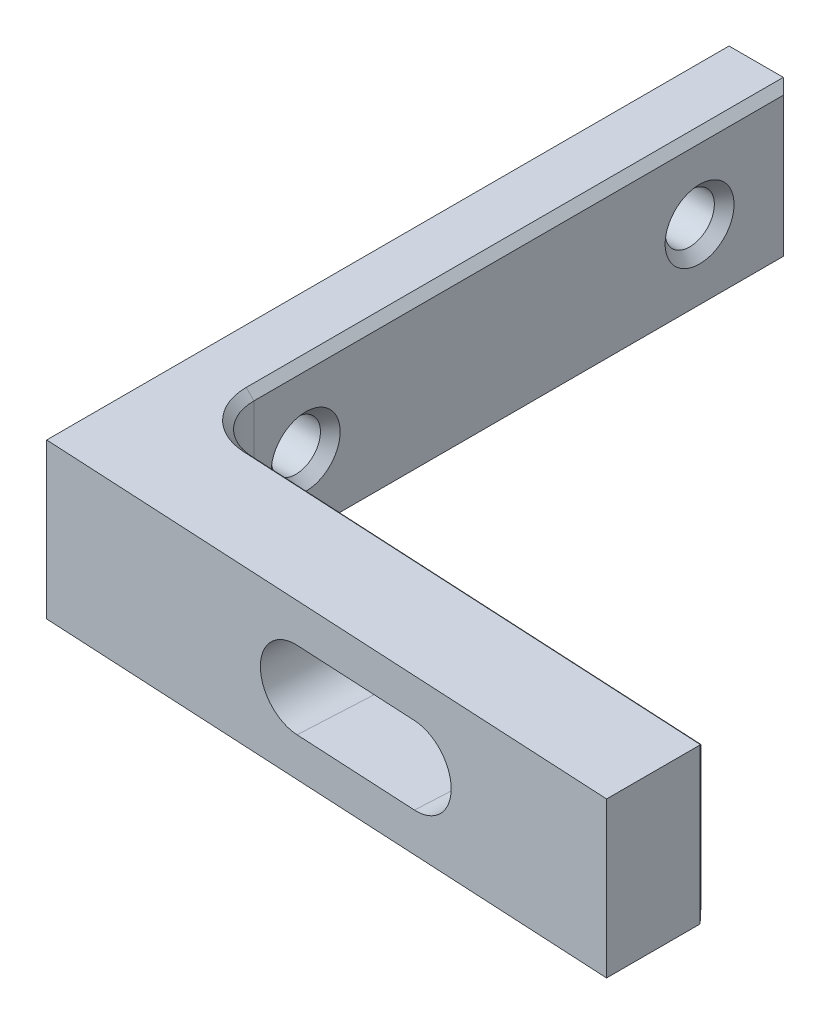
ISO-10303-21;
HEADER;
FILE_DESCRIPTION(('STEP AP214'),'2;1');
FILE_NAME('part.step','',(''),(''),'','','');
FILE_SCHEMA(('AUTOMOTIVE_DESIGN { 1 0 10303 214 1 1 1 1 }'));
ENDSEC;
DATA;
#1=APPLICATION_CONTEXT('core data for automotive mechanical design processes');
#2=APPLICATION_PROTOCOL_DEFINITION('international standard','automotive_design',2000,#1);
#3=PRODUCT_CONTEXT('',#1,'mechanical');
#4=PRODUCT('Part','Part','',(#3));
#5=PRODUCT_RELATED_PRODUCT_CATEGORY('part','',(#4));
#6=PRODUCT_DEFINITION_FORMATION('','',#4);
#7=PRODUCT_DEFINITION_CONTEXT('part definition',#1,'design');
#8=PRODUCT_DEFINITION('design','',#6,#7);
#9=PRODUCT_DEFINITION_SHAPE('','',#8);
#10=(LENGTH_UNIT() NAMED_UNIT(*) SI_UNIT(.MILLI.,.METRE.));
#11=(NAMED_UNIT(*) PLANE_ANGLE_UNIT() SI_UNIT($,.RADIAN.));
#12=(NAMED_UNIT(*) SI_UNIT($,.STERADIAN.) SOLID_ANGLE_UNIT());
#13=UNCERTAINTY_MEASURE_WITH_UNIT(LENGTH_MEASURE(1.E-05),#10,'distance_accuracy_value','');
#14=(GEOMETRIC_REPRESENTATION_CONTEXT(3) GLOBAL_UNCERTAINTY_ASSIGNED_CONTEXT((#13)) GLOBAL_UNIT_ASSIGNED_CONTEXT((#10,
#11,#12)) REPRESENTATION_CONTEXT('',''));
#15=CARTESIAN_POINT('',(0.,0.,0.));
#16=DIRECTION('',(0.,0.,1.));
#17=DIRECTION('',(1.,0.,0.));
#18=AXIS2_PLACEMENT_3D('',#15,#16,#17);
#19=CARTESIAN_POINT('',(19.05,10.,22.));
#20=DIRECTION('',(-1.,0.,0.));
#21=DIRECTION('',(0.,0.,1.));
#22=AXIS2_PLACEMENT_3D('',#19,#20,#21);
#23=PLANE('',#22);
#24=DIRECTION('',(0.,0.,-1.));
#25=VECTOR('',#24,1.);
#26=CARTESIAN_POINT('',(19.05,0.,22.));
#27=LINE('',#26,#25);
#28=CARTESIAN_POINT('',(19.05,0.,23.9967363906839));
#29=VERTEX_POINT('',#28);
#30=CARTESIAN_POINT('',(19.05,0.,17.9654825249185));
#31=VERTEX_POINT('',#30);
#32=EDGE_CURVE('E211',#29,#31,#27,.T.);
#33=ORIENTED_EDGE('',*,*,#32,.T.);
#34=DIRECTION('',(0.,1.,0.));
#35=VECTOR('',#34,1.);
#36=CARTESIAN_POINT('',(19.05,10.,17.9654825249185));
#37=LINE('',#36,#35);
#38=CARTESIAN_POINT('',(19.05,10.,17.9654825249185));
#39=VERTEX_POINT('',#38);
#40=EDGE_CURVE('E260',#31,#39,#37,.T.);
#41=ORIENTED_EDGE('',*,*,#40,.T.);
#42=DIRECTION('',(0.,0.,-1.));
#43=VECTOR('',#42,1.);
#44=CARTESIAN_POINT('',(19.05,10.,22.));
#45=LINE('',#44,#43);
#46=CARTESIAN_POINT('',(19.05,10.,23.9967363906839));
#47=VERTEX_POINT('',#46);
#48=EDGE_CURVE('E212',#47,#39,#45,.T.);
#49=ORIENTED_EDGE('',*,*,#48,.F.);
#50=DIRECTION('',(0.,1.,0.));
#51=VECTOR('',#50,1.);
#52=CARTESIAN_POINT('',(19.05,10.,23.9967363906839));
#53=LINE('',#52,#51);
#54=EDGE_CURVE('E231',#47,#29,#53,.F.);
#55=ORIENTED_EDGE('',*,*,#54,.T.);
#56=EDGE_LOOP('',(#33,#41,#49,#55));
#57=FACE_BOUND('',#56,.T.);
#58=ADVANCED_FACE('F31',(#57),#23,.F.);
#59=CARTESIAN_POINT('',(-19.05,10.,-22.));
#60=DIRECTION('',(0.,0.,1.));
#61=DIRECTION('',(1.,0.,0.));
#62=AXIS2_PLACEMENT_3D('',#59,#60,#61);
#63=PLANE('',#62);
#64=DIRECTION('',(-1.,0.,0.));
#65=VECTOR('',#64,1.);
#66=CARTESIAN_POINT('',(-19.05,10.,-22.));
#67=LINE('',#66,#65);
#68=CARTESIAN_POINT('',(-15.55,10.,-22.));
#69=VERTEX_POINT('',#68);
#70=CARTESIAN_POINT('',(-19.05,10.,-22.));
#71=VERTEX_POINT('',#70);
#72=EDGE_CURVE('E215',#69,#71,#67,.T.);
#73=ORIENTED_EDGE('',*,*,#72,.F.);
#74=DIRECTION('',(0.,-1.,0.));
#75=VECTOR('',#74,1.);
#76=CARTESIAN_POINT('',(-15.55,10.,-22.));
#77=LINE('',#76,#75);
#78=CARTESIAN_POINT('',(-15.55,0.,-22.));
#79=VERTEX_POINT('',#78);
#80=EDGE_CURVE('E11',#69,#79,#77,.T.);
#81=ORIENTED_EDGE('',*,*,#80,.T.);
#82=DIRECTION('',(-1.,0.,0.));
#83=VECTOR('',#82,1.);
#84=CARTESIAN_POINT('',(-19.05,0.,-22.));
#85=LINE('',#84,#83);
#86=CARTESIAN_POINT('',(-19.05,0.,-22.));
#87=VERTEX_POINT('',#86);
#88=EDGE_CURVE('E223',#79,#87,#85,.T.);
#89=ORIENTED_EDGE('',*,*,#88,.T.);
#90=DIRECTION('',(0.,-1.,0.));
#91=VECTOR('',#90,1.);
#92=CARTESIAN_POINT('',(-19.05,10.,-22.));
#93=LINE('',#92,#91);
#94=EDGE_CURVE('E230',#71,#87,#93,.T.);
#95=ORIENTED_EDGE('',*,*,#94,.F.);
#96=EDGE_LOOP('',(#73,#81,#89,#95));
#97=FACE_BOUND('',#96,.T.);
#98=ADVANCED_FACE('F359',(#97),#63,.F.);
#99=CARTESIAN_POINT('',(-19.05,10.,22.));
#100=DIRECTION('',(1.,0.,0.));
#101=DIRECTION('',(0.,0.,-1.));
#102=AXIS2_PLACEMENT_3D('',#99,#100,#101);
#103=PLANE('',#102);
#104=CARTESIAN_POINT('',(-19.05,5.,-16.1));
#105=DIRECTION('',(-1.,0.,0.));
#106=DIRECTION('',(0.,0.,1.));
#107=AXIS2_PLACEMENT_3D('',#104,#105,#106);
#108=CIRCLE('',#107,2.2225);
#109=CARTESIAN_POINT('',(-19.05,5.,-13.8775));
#110=VERTEX_POINT('',#109);
#111=EDGE_CURVE('E186',#110,#110,#108,.T.);
#112=ORIENTED_EDGE('',*,*,#111,.F.);
#113=EDGE_LOOP('',(#112));
#114=FACE_BOUND('',#113,.T.);
#115=CARTESIAN_POINT('',(-19.05,5.,9.3));
#116=DIRECTION('',(-1.,0.,0.));
#117=DIRECTION('',(0.,0.,1.));
#118=AXIS2_PLACEMENT_3D('',#115,#116,#117);
#119=CIRCLE('',#118,2.2225);
#120=CARTESIAN_POINT('',(-19.05,5.,11.5225));
#121=VERTEX_POINT('',#120);
#122=EDGE_CURVE('E202',#121,#121,#119,.T.);
#123=ORIENTED_EDGE('',*,*,#122,.F.);
#124=EDGE_LOOP('',(#123));
#125=FACE_BOUND('',#124,.T.);
#126=DIRECTION('',(0.,0.,1.));
#127=VECTOR('',#126,1.);
#128=CARTESIAN_POINT('',(-19.05,0.,22.));
#129=LINE('',#128,#127);
#130=CARTESIAN_POINT('',(-19.05,0.,22.));
#131=VERTEX_POINT('',#130);
#132=EDGE_CURVE('E225',#87,#131,#129,.T.);
#133=ORIENTED_EDGE('',*,*,#132,.T.);
#134=DIRECTION('',(0.,-1.,0.));
#135=VECTOR('',#134,1.);
#136=CARTESIAN_POINT('',(-19.05,10.,22.));
#137=LINE('',#136,#135);
#138=CARTESIAN_POINT('',(-19.05,10.,22.));
#139=VERTEX_POINT('',#138);
#140=EDGE_CURVE('E227',#139,#131,#137,.T.);
#141=ORIENTED_EDGE('',*,*,#140,.F.);
#142=DIRECTION('',(0.,0.,1.));
#143=VECTOR('',#142,1.);
#144=CARTESIAN_POINT('',(-19.05,10.,22.));
#145=LINE('',#144,#143);
#146=EDGE_CURVE('E218',#71,#139,#145,.T.);
#147=ORIENTED_EDGE('',*,*,#146,.F.);
#148=ORIENTED_EDGE('',*,*,#94,.T.);
#149=EDGE_LOOP('',(#133,#141,#147,#148));
#150=FACE_BOUND('',#149,.T.);
#151=ADVANCED_FACE('F362',(#114,#125,#150),#103,.F.);
#152=CARTESIAN_POINT('',(-19.05,10.,22.));
#153=DIRECTION('',(-0.0523359562429439,0.,0.998629534754574));
#154=DIRECTION('',(0.998629534754574,0.,0.052335956242944));
#155=AXIS2_PLACEMENT_3D('',#152,#153,#154);
#156=PLANE('',#155);
#157=DIRECTION('',(-0.998629534754574,0.,-0.052335956242944));
#158=VECTOR('',#157,1.);
#159=CARTESIAN_POINT('',(-19.05,7.5,22.));
#160=LINE('',#159,#158);
#161=CARTESIAN_POINT('',(-2.01119831442696,7.5,22.892965757985));
#162=VERTEX_POINT('',#161);
#163=CARTESIAN_POINT('',(5.97783796360964,7.5,23.3116534079286));
#164=VERTEX_POINT('',#163);
#165=EDGE_CURVE('E182',#162,#164,#160,.F.);
#166=ORIENTED_EDGE('',*,*,#165,.T.);
#167=CARTESIAN_POINT('',(5.97783796360963,5.,23.3116534079286));
#168=DIRECTION('',(-0.0523359562429439,0.,0.998629534754574));
#169=DIRECTION('',(0.998629534754574,0.,0.052335956242944));
#170=AXIS2_PLACEMENT_3D('',#167,#168,#169);
#171=CIRCLE('',#170,2.5);
#172=CARTESIAN_POINT('',(5.97783796360964,2.5,23.3116534079286));
#173=VERTEX_POINT('',#172);
#174=EDGE_CURVE('E173',#164,#173,#171,.F.);
#175=ORIENTED_EDGE('',*,*,#174,.T.);
#176=DIRECTION('',(0.998629534754574,0.,0.052335956242944));
#177=VECTOR('',#176,1.);
#178=CARTESIAN_POINT('',(-19.05,2.5,22.));
#179=LINE('',#178,#177);
#180=CARTESIAN_POINT('',(-2.01119831442696,2.5,22.892965757985));
#181=VERTEX_POINT('',#180);
#182=EDGE_CURVE('E156',#173,#181,#179,.F.);
#183=ORIENTED_EDGE('',*,*,#182,.T.);
#184=CARTESIAN_POINT('',(-2.01119831442696,5.,22.892965757985));
#185=DIRECTION('',(-0.0523359562429439,0.,0.998629534754574));
#186=DIRECTION('',(0.998629534754574,0.,0.052335956242944));
#187=AXIS2_PLACEMENT_3D('',#184,#185,#186);
#188=CIRCLE('',#187,2.5);
#189=EDGE_CURVE('E167',#181,#162,#188,.F.);
#190=ORIENTED_EDGE('',*,*,#189,.T.);
#191=EDGE_LOOP('',(#166,#175,#183,#190));
#192=FACE_BOUND('',#191,.T.);
#193=DIRECTION('',(-0.998629534754574,0.,-0.052335956242944));
#194=VECTOR('',#193,1.);
#195=CARTESIAN_POINT('',(16.6460159148772,0.,23.8707489233508));
#196=LINE('',#195,#194);
#197=EDGE_CURVE('E216',#131,#29,#196,.F.);
#198=ORIENTED_EDGE('',*,*,#197,.T.);
#199=ORIENTED_EDGE('',*,*,#54,.F.);
#200=DIRECTION('',(-0.998629534754574,0.,-0.052335956242944));
#201=VECTOR('',#200,1.);
#202=CARTESIAN_POINT('',(16.6460159148772,10.,23.8707489233508));
#203=LINE('',#202,#201);
#204=EDGE_CURVE('E220',#139,#47,#203,.F.);
#205=ORIENTED_EDGE('',*,*,#204,.F.);
#206=ORIENTED_EDGE('',*,*,#140,.T.);
#207=EDGE_LOOP('',(#198,#199,#205,#206));
#208=FACE_BOUND('',#207,.T.);
#209=ADVANCED_FACE('F180',(#192,#208),#156,.T.);
#210=CARTESIAN_POINT('',(19.05,10.,-22.));
#211=DIRECTION('',(0.,-1.,0.));
#212=DIRECTION('',(0.,0.,-1.));
#213=AXIS2_PLACEMENT_3D('',#210,#211,#212);
#214=PLANE('',#213);
#215=ORIENTED_EDGE('',*,*,#48,.T.);
#216=DIRECTION('',(0.669130606358856,0.,0.743144825477396));
#217=VECTOR('',#216,1.);
#218=CARTESIAN_POINT('',(19.05,10.,17.9654825249185));
#219=LINE('',#218,#217);
#220=CARTESIAN_POINT('',(19.0238320218786,10.,17.936420040929));
#221=VERTEX_POINT('',#220);
#222=EDGE_CURVE('E278',#39,#221,#219,.F.);
#223=ORIENTED_EDGE('',*,*,#222,.T.);
#224=DIRECTION('',(-0.998629534754574,0.,-0.052335956242944));
#225=VECTOR('',#224,1.);
#226=CARTESIAN_POINT('',(16.962682016894,10.,17.8283997463985));
#227=LINE('',#226,#225);
#228=CARTESIAN_POINT('',(-12.0673346391928,10.,16.3070010409033));
#229=VERTEX_POINT('',#228);
#230=EDGE_CURVE('E276',#221,#229,#227,.T.);
#231=ORIENTED_EDGE('',*,*,#230,.T.);
#232=CARTESIAN_POINT('',(-11.875,10.,12.6370375006803));
#233=DIRECTION('',(0.,-1.,0.));
#234=DIRECTION('',(0.,0.,-1.));
#235=AXIS2_PLACEMENT_3D('',#232,#233,#234);
#236=CIRCLE('',#235,3.675);
#237=CARTESIAN_POINT('',(-15.55,10.,12.6370375006803));
#238=VERTEX_POINT('',#237);
#239=EDGE_CURVE('E274',#229,#238,#236,.T.);
#240=ORIENTED_EDGE('',*,*,#239,.T.);
#241=DIRECTION('',(0.,0.,-1.));
#242=VECTOR('',#241,1.);
#243=CARTESIAN_POINT('',(-15.55,10.,-22.));
#244=LINE('',#243,#242);
#245=EDGE_CURVE('E272',#238,#69,#244,.T.);
#246=ORIENTED_EDGE('',*,*,#245,.T.);
#247=ORIENTED_EDGE('',*,*,#72,.T.);
#248=ORIENTED_EDGE('',*,*,#146,.T.);
#249=ORIENTED_EDGE('',*,*,#204,.T.);
#250=EDGE_LOOP('',(#215,#223,#231,#240,#246,#247,#248,#249));
#251=FACE_BOUND('',#250,.T.);
#252=ADVANCED_FACE('F366',(#251),#214,.F.);
#253=CARTESIAN_POINT('',(19.05,0.,-22.));
#254=DIRECTION('',(0.,-1.,0.));
#255=DIRECTION('',(0.,0.,-1.));
#256=AXIS2_PLACEMENT_3D('',#253,#254,#255);
#257=PLANE('',#256);
#258=DIRECTION('',(0.998629534754574,0.,0.052335956242944));
#259=VECTOR('',#258,1.);
#260=CARTESIAN_POINT('',(19.0238320218785,0.,17.936420040929));
#261=LINE('',#260,#259);
#262=CARTESIAN_POINT('',(-12.0673346391928,0.,16.3070010409033));
#263=VERTEX_POINT('',#262);
#264=CARTESIAN_POINT('',(19.0238320218786,0.,17.936420040929));
#265=VERTEX_POINT('',#264);
#266=EDGE_CURVE('E291',#263,#265,#261,.T.);
#267=ORIENTED_EDGE('',*,*,#266,.T.);
#268=DIRECTION('',(-0.669130606358856,0.,-0.743144825477396));
#269=VECTOR('',#268,1.);
#270=CARTESIAN_POINT('',(-0.823273714994747,0.,-4.10602397358089));
#271=LINE('',#270,#269);
#272=EDGE_CURVE('E293',#265,#31,#271,.F.);
#273=ORIENTED_EDGE('',*,*,#272,.T.);
#274=ORIENTED_EDGE('',*,*,#32,.F.);
#275=ORIENTED_EDGE('',*,*,#197,.F.);
#276=ORIENTED_EDGE('',*,*,#132,.F.);
#277=ORIENTED_EDGE('',*,*,#88,.F.);
#278=DIRECTION('',(0.,0.,1.));
#279=VECTOR('',#278,1.);
#280=CARTESIAN_POINT('',(-15.55,0.,12.6370375006803));
#281=LINE('',#280,#279);
#282=CARTESIAN_POINT('',(-15.55,0.,12.6370375006803));
#283=VERTEX_POINT('',#282);
#284=EDGE_CURVE('E287',#79,#283,#281,.T.);
#285=ORIENTED_EDGE('',*,*,#284,.T.);
#286=CARTESIAN_POINT('',(-11.875,0.,12.6370375006803));
#287=DIRECTION('',(0.,-1.,0.));
#288=DIRECTION('',(0.,0.,-1.));
#289=AXIS2_PLACEMENT_3D('',#286,#287,#288);
#290=CIRCLE('',#289,3.675);
#291=EDGE_CURVE('E289',#283,#263,#290,.F.);
#292=ORIENTED_EDGE('',*,*,#291,.T.);
#293=EDGE_LOOP('',(#267,#273,#274,#275,#276,#277,#285,#292));
#294=FACE_BOUND('',#293,.T.);
#295=ADVANCED_FACE('F351',(#294),#257,.T.);
#296=CARTESIAN_POINT('',(-15.05,-0.000999999999999265,-22.));
#297=DIRECTION('',(-1.,0.,0.));
#298=DIRECTION('',(0.,0.,1.));
#299=AXIS2_PLACEMENT_3D('',#296,#297,#298);
#300=PLANE('',#299);
#301=CARTESIAN_POINT('',(-15.05,5.,-16.1));
#302=DIRECTION('',(-1.,0.,0.));
#303=DIRECTION('',(0.,0.,1.));
#304=AXIS2_PLACEMENT_3D('',#301,#302,#303);
#305=CIRCLE('',#304,2.2225);
#306=CARTESIAN_POINT('',(-15.05,5.,-13.8775));
#307=VERTEX_POINT('',#306);
#308=EDGE_CURVE('E183',#307,#307,#305,.T.);
#309=ORIENTED_EDGE('',*,*,#308,.T.);
#310=EDGE_LOOP('',(#309));
#311=FACE_BOUND('',#310,.T.);
#312=CARTESIAN_POINT('',(-15.05,5.,9.3));
#313=DIRECTION('',(-1.,0.,0.));
#314=DIRECTION('',(0.,0.,1.));
#315=AXIS2_PLACEMENT_3D('',#312,#313,#314);
#316=CIRCLE('',#315,2.2225);
#317=CARTESIAN_POINT('',(-15.05,5.,11.5225));
#318=VERTEX_POINT('',#317);
#319=EDGE_CURVE('E199',#318,#318,#316,.T.);
#320=ORIENTED_EDGE('',*,*,#319,.T.);
#321=EDGE_LOOP('',(#320));
#322=FACE_BOUND('',#321,.T.);
#323=DIRECTION('',(0.,1.,0.));
#324=VECTOR('',#323,1.);
#325=CARTESIAN_POINT('',(-15.05,-0.000999999999999265,-21.5));
#326=LINE('',#325,#324);
#327=CARTESIAN_POINT('',(-15.05,0.5,-21.5));
#328=VERTEX_POINT('',#327);
#329=CARTESIAN_POINT('',(-15.05,9.5,-21.5));
#330=VERTEX_POINT('',#329);
#331=EDGE_CURVE('E48',#328,#330,#326,.T.);
#332=ORIENTED_EDGE('',*,*,#331,.T.);
#333=DIRECTION('',(0.,0.,1.));
#334=VECTOR('',#333,1.);
#335=CARTESIAN_POINT('',(-15.05,9.5,-22.));
#336=LINE('',#335,#334);
#337=CARTESIAN_POINT('',(-15.05,9.5,12.6370375006803));
#338=VERTEX_POINT('',#337);
#339=EDGE_CURVE('E40',#330,#338,#336,.T.);
#340=ORIENTED_EDGE('',*,*,#339,.T.);
#341=DIRECTION('',(0.,1.,0.));
#342=VECTOR('',#341,1.);
#343=CARTESIAN_POINT('',(-15.05,0.,12.6370375006803));
#344=LINE('',#343,#342);
#345=CARTESIAN_POINT('',(-15.05,0.5,12.6370375006803));
#346=VERTEX_POINT('',#345);
#347=EDGE_CURVE('E241',#338,#346,#344,.F.);
#348=ORIENTED_EDGE('',*,*,#347,.T.);
#349=DIRECTION('',(0.,0.,-1.));
#350=VECTOR('',#349,1.);
#351=CARTESIAN_POINT('',(-15.05,0.5,-22.));
#352=LINE('',#351,#350);
#353=EDGE_CURVE('E53',#346,#328,#352,.T.);
#354=ORIENTED_EDGE('',*,*,#353,.T.);
#355=EDGE_LOOP('',(#332,#340,#348,#354));
#356=FACE_BOUND('',#355,.T.);
#357=ADVANCED_FACE('F335',(#311,#322,#356),#300,.F.);
#358=CARTESIAN_POINT('',(-15.685,5.,9.3));
#359=DIRECTION('',(1.,0.,0.));
#360=DIRECTION('',(0.,0.,-1.));
#361=AXIS2_PLACEMENT_3D('',#358,#359,#360);
#362=CONICAL_SURFACE('',#361,1.5875,0.785398163397448);
#363=ORIENTED_EDGE('',*,*,#319,.F.);
#364=EDGE_LOOP('',(#363));
#365=FACE_BOUND('',#364,.T.);
#366=CARTESIAN_POINT('',(-15.685,5.,9.3));
#367=DIRECTION('',(-1.,0.,0.));
#368=DIRECTION('',(0.,0.,1.));
#369=AXIS2_PLACEMENT_3D('',#366,#367,#368);
#370=CIRCLE('',#369,1.5875);
#371=CARTESIAN_POINT('',(-15.685,5.,10.8875));
#372=VERTEX_POINT('',#371);
#373=EDGE_CURVE('E208',#372,#372,#370,.T.);
#374=ORIENTED_EDGE('',*,*,#373,.T.);
#375=EDGE_LOOP('',(#374));
#376=FACE_BOUND('',#375,.T.);
#377=ADVANCED_FACE('F408',(#365,#376),#362,.F.);
#378=CARTESIAN_POINT('',(-19.05,5.,9.3));
#379=DIRECTION('',(-1.,0.,0.));
#380=DIRECTION('',(0.,0.,1.));
#381=AXIS2_PLACEMENT_3D('',#378,#379,#380);
#382=CYLINDRICAL_SURFACE('',#381,1.5875);
#383=ORIENTED_EDGE('',*,*,#373,.F.);
#384=EDGE_LOOP('',(#383));
#385=FACE_BOUND('',#384,.T.);
#386=CARTESIAN_POINT('',(-18.415,5.,9.3));
#387=DIRECTION('',(-1.,0.,0.));
#388=DIRECTION('',(0.,0.,1.));
#389=AXIS2_PLACEMENT_3D('',#386,#387,#388);
#390=CIRCLE('',#389,1.5875);
#391=CARTESIAN_POINT('',(-18.415,5.,10.8875));
#392=VERTEX_POINT('',#391);
#393=EDGE_CURVE('E205',#392,#392,#390,.T.);
#394=ORIENTED_EDGE('',*,*,#393,.T.);
#395=EDGE_LOOP('',(#394));
#396=FACE_BOUND('',#395,.T.);
#397=ADVANCED_FACE('F412',(#385,#396),#382,.F.);
#398=CARTESIAN_POINT('',(-19.05,5.,9.3));
#399=DIRECTION('',(-1.,0.,0.));
#400=DIRECTION('',(0.,0.,1.));
#401=AXIS2_PLACEMENT_3D('',#398,#399,#400);
#402=CONICAL_SURFACE('',#401,2.2225,0.785398163397448);
#403=ORIENTED_EDGE('',*,*,#393,.F.);
#404=EDGE_LOOP('',(#403));
#405=FACE_BOUND('',#404,.T.);
#406=ORIENTED_EDGE('',*,*,#122,.T.);
#407=EDGE_LOOP('',(#406));
#408=FACE_BOUND('',#407,.T.);
#409=ADVANCED_FACE('F416',(#405,#408),#402,.F.);
#410=CARTESIAN_POINT('',(-15.685,5.,-16.1));
#411=DIRECTION('',(1.,0.,0.));
#412=DIRECTION('',(0.,0.,-1.));
#413=AXIS2_PLACEMENT_3D('',#410,#411,#412);
#414=CONICAL_SURFACE('',#413,1.5875,0.785398163397448);
#415=ORIENTED_EDGE('',*,*,#308,.F.);
#416=EDGE_LOOP('',(#415));
#417=FACE_BOUND('',#416,.T.);
#418=CARTESIAN_POINT('',(-15.685,5.,-16.1));
#419=DIRECTION('',(-1.,0.,0.));
#420=DIRECTION('',(0.,0.,1.));
#421=AXIS2_PLACEMENT_3D('',#418,#419,#420);
#422=CIRCLE('',#421,1.5875);
#423=CARTESIAN_POINT('',(-15.685,5.,-14.5125));
#424=VERTEX_POINT('',#423);
#425=EDGE_CURVE('E196',#424,#424,#422,.T.);
#426=ORIENTED_EDGE('',*,*,#425,.T.);
#427=EDGE_LOOP('',(#426));
#428=FACE_BOUND('',#427,.T.);
#429=ADVANCED_FACE('F420',(#417,#428),#414,.F.);
#430=CARTESIAN_POINT('',(-19.05,5.,-16.1));
#431=DIRECTION('',(-1.,0.,0.));
#432=DIRECTION('',(0.,0.,1.));
#433=AXIS2_PLACEMENT_3D('',#430,#431,#432);
#434=CYLINDRICAL_SURFACE('',#433,1.5875);
#435=ORIENTED_EDGE('',*,*,#425,.F.);
#436=EDGE_LOOP('',(#435));
#437=FACE_BOUND('',#436,.T.);
#438=CARTESIAN_POINT('',(-18.415,5.,-16.1));
#439=DIRECTION('',(-1.,0.,0.));
#440=DIRECTION('',(0.,0.,1.));
#441=AXIS2_PLACEMENT_3D('',#438,#439,#440);
#442=CIRCLE('',#441,1.5875);
#443=CARTESIAN_POINT('',(-18.415,5.,-14.5125));
#444=VERTEX_POINT('',#443);
#445=EDGE_CURVE('E193',#444,#444,#442,.T.);
#446=ORIENTED_EDGE('',*,*,#445,.T.);
#447=EDGE_LOOP('',(#446));
#448=FACE_BOUND('',#447,.T.);
#449=ADVANCED_FACE('F424',(#437,#448),#434,.F.);
#450=CARTESIAN_POINT('',(-19.05,5.,-16.1));
#451=DIRECTION('',(-1.,0.,0.));
#452=DIRECTION('',(0.,0.,1.));
#453=AXIS2_PLACEMENT_3D('',#450,#451,#452);
#454=CONICAL_SURFACE('',#453,2.2225,0.785398163397448);
#455=ORIENTED_EDGE('',*,*,#445,.F.);
#456=EDGE_LOOP('',(#455));
#457=FACE_BOUND('',#456,.T.);
#458=ORIENTED_EDGE('',*,*,#111,.T.);
#459=EDGE_LOOP('',(#458));
#460=FACE_BOUND('',#459,.T.);
#461=ADVANCED_FACE('F428',(#457,#460),#454,.F.);
#462=CARTESIAN_POINT('',(-15.05,0.,15.65));
#463=DIRECTION('',(-0.052335956242944,0.,0.998629534754574));
#464=DIRECTION('',(0.998629534754574,0.,0.052335956242944));
#465=AXIS2_PLACEMENT_3D('',#462,#463,#464);
#466=PLANE('',#465);
#467=CARTESIAN_POINT('',(6.32067204374788,5.,16.769989463599));
#468=DIRECTION('',(-0.052335956242944,0.,0.998629534754574));
#469=DIRECTION('',(0.998629534754574,0.,0.052335956242944));
#470=AXIS2_PLACEMENT_3D('',#467,#468,#469);
#471=CIRCLE('',#470,3.00000000000001);
#472=CARTESIAN_POINT('',(6.32067204374789,1.99999999999999,16.769989463599));
#473=VERTEX_POINT('',#472);
#474=CARTESIAN_POINT('',(6.32067204374789,8.00000000000001,16.769989463599));
#475=VERTEX_POINT('',#474);
#476=EDGE_CURVE('E250',#473,#475,#471,.T.);
#477=ORIENTED_EDGE('',*,*,#476,.T.);
#478=DIRECTION('',(-0.998629534754574,0.,-0.052335956242944));
#479=VECTOR('',#478,1.);
#480=CARTESIAN_POINT('',(-15.05,8.00000000000001,15.65));
#481=LINE('',#480,#479);
#482=CARTESIAN_POINT('',(-1.66836423428871,8.00000000000001,16.3513018136554));
#483=VERTEX_POINT('',#482);
#484=EDGE_CURVE('E252',#475,#483,#481,.T.);
#485=ORIENTED_EDGE('',*,*,#484,.T.);
#486=CARTESIAN_POINT('',(-1.66836423428871,5.,16.3513018136554));
#487=DIRECTION('',(-0.052335956242944,0.,0.998629534754574));
#488=DIRECTION('',(0.998629534754574,0.,0.052335956242944));
#489=AXIS2_PLACEMENT_3D('',#486,#487,#488);
#490=CIRCLE('',#489,3.00000000000001);
#491=CARTESIAN_POINT('',(-1.66836423428871,1.99999999999999,16.3513018136554));
#492=VERTEX_POINT('',#491);
#493=EDGE_CURVE('E248',#483,#492,#490,.T.);
#494=ORIENTED_EDGE('',*,*,#493,.T.);
#495=DIRECTION('',(0.998629534754574,0.,0.052335956242944));
#496=VECTOR('',#495,1.);
#497=CARTESIAN_POINT('',(-15.05,1.99999999999999,15.65));
#498=LINE('',#497,#496);
#499=EDGE_CURVE('E246',#492,#473,#498,.T.);
#500=ORIENTED_EDGE('',*,*,#499,.T.);
#501=EDGE_LOOP('',(#477,#485,#494,#500));
#502=FACE_BOUND('',#501,.T.);
#503=DIRECTION('',(0.,1.,0.));
#504=VECTOR('',#503,1.);
#505=CARTESIAN_POINT('',(-12.0411666610713,10.,15.807686273526));
#506=LINE('',#505,#504);
#507=CARTESIAN_POINT('',(-12.0411666610713,0.5,15.807686273526));
#508=VERTEX_POINT('',#507);
#509=CARTESIAN_POINT('',(-12.0411666610713,9.5,15.807686273526));
#510=VERTEX_POINT('',#509);
#511=EDGE_CURVE('E234',#508,#510,#506,.T.);
#512=ORIENTED_EDGE('',*,*,#511,.T.);
#513=DIRECTION('',(0.998629534754574,0.,0.052335956242944));
#514=VECTOR('',#513,1.);
#515=CARTESIAN_POINT('',(-15.05,9.5,15.65));
#516=LINE('',#515,#514);
#517=CARTESIAN_POINT('',(18.5506852326227,9.5,17.4109372954302));
#518=VERTEX_POINT('',#517);
#519=EDGE_CURVE('E285',#510,#518,#516,.T.);
#520=ORIENTED_EDGE('',*,*,#519,.T.);
#521=DIRECTION('',(0.,-1.,0.));
#522=VECTOR('',#521,1.);
#523=CARTESIAN_POINT('',(18.5506852326227,0.,17.4109372954302));
#524=LINE('',#523,#522);
#525=CARTESIAN_POINT('',(18.5506852326227,0.5,17.4109372954302));
#526=VERTEX_POINT('',#525);
#527=EDGE_CURVE('E282',#518,#526,#524,.T.);
#528=ORIENTED_EDGE('',*,*,#527,.T.);
#529=DIRECTION('',(-0.998629534754574,0.,-0.052335956242944));
#530=VECTOR('',#529,1.);
#531=CARTESIAN_POINT('',(-12.0411666610713,0.5,15.807686273526));
#532=LINE('',#531,#530);
#533=EDGE_CURVE('E280',#526,#508,#532,.T.);
#534=ORIENTED_EDGE('',*,*,#533,.T.);
#535=EDGE_LOOP('',(#512,#520,#528,#534));
#536=FACE_BOUND('',#535,.T.);
#537=ADVANCED_FACE('F379',(#502,#536),#466,.F.);
#538=CARTESIAN_POINT('',(5.87348007037524,5.,25.3029206331774));
#539=DIRECTION('',(0.052335956242944,0.,-0.998629534754574));
#540=DIRECTION('',(-0.998629534754574,0.,-0.052335956242944));
#541=AXIS2_PLACEMENT_3D('',#538,#539,#540);
#542=CYLINDRICAL_SURFACE('',#541,2.5);
#543=DIRECTION('',(0.052335956242944,0.,-0.998629534754574));
#544=VECTOR('',#543,1.);
#545=CARTESIAN_POINT('',(5.87348007037524,7.5,25.3029206331774));
#546=LINE('',#545,#544);
#547=CARTESIAN_POINT('',(6.29450406562641,7.5,17.2693042309763));
#548=VERTEX_POINT('',#547);
#549=EDGE_CURVE('E168',#164,#548,#546,.T.);
#550=ORIENTED_EDGE('',*,*,#549,.T.);
#551=CARTESIAN_POINT('',(6.29450406562641,5.,17.2693042309763));
#552=DIRECTION('',(-0.052335956242944,0.,0.998629534754574));
#553=DIRECTION('',(0.998629534754574,0.,0.052335956242944));
#554=AXIS2_PLACEMENT_3D('',#551,#552,#553);
#555=CIRCLE('',#554,2.5);
#556=CARTESIAN_POINT('',(6.29450406562641,2.5,17.2693042309763));
#557=VERTEX_POINT('',#556);
#558=EDGE_CURVE('E176',#548,#557,#555,.F.);
#559=ORIENTED_EDGE('',*,*,#558,.T.);
#560=DIRECTION('',(0.052335956242944,0.,-0.998629534754574));
#561=VECTOR('',#560,1.);
#562=CARTESIAN_POINT('',(5.87348007037524,2.5,25.3029206331774));
#563=LINE('',#562,#561);
#564=EDGE_CURVE('E159',#173,#557,#563,.T.);
#565=ORIENTED_EDGE('',*,*,#564,.F.);
#566=ORIENTED_EDGE('',*,*,#174,.F.);
#567=EDGE_LOOP('',(#550,#559,#565,#566));
#568=FACE_BOUND('',#567,.T.);
#569=ADVANCED_FACE('F172',(#568),#542,.F.);
#570=CARTESIAN_POINT('',(5.87348007037524,7.5,25.3029206331774));
#571=DIRECTION('',(0.,1.,0.));
#572=DIRECTION('',(0.,0.,1.));
#573=AXIS2_PLACEMENT_3D('',#570,#571,#572);
#574=PLANE('',#573);
#575=DIRECTION('',(0.052335956242944,0.,-0.998629534754574));
#576=VECTOR('',#575,1.);
#577=CARTESIAN_POINT('',(-2.11555620766135,7.5,24.8842329832338));
#578=LINE('',#577,#576);
#579=CARTESIAN_POINT('',(-1.69453221241018,7.5,16.8506165810327));
#580=VERTEX_POINT('',#579);
#581=EDGE_CURVE('E451',#162,#580,#578,.T.);
#582=ORIENTED_EDGE('',*,*,#581,.T.);
#583=DIRECTION('',(0.998629534754574,0.,0.052335956242944));
#584=VECTOR('',#583,1.);
#585=CARTESIAN_POINT('',(6.29450406562641,7.5,17.2693042309763));
#586=LINE('',#585,#584);
#587=EDGE_CURVE('E243',#580,#548,#586,.T.);
#588=ORIENTED_EDGE('',*,*,#587,.T.);
#589=ORIENTED_EDGE('',*,*,#549,.F.);
#590=ORIENTED_EDGE('',*,*,#165,.F.);
#591=EDGE_LOOP('',(#582,#588,#589,#590));
#592=FACE_BOUND('',#591,.T.);
#593=ADVANCED_FACE('F438',(#592),#574,.F.);
#594=CARTESIAN_POINT('',(-2.11555620766135,5.,24.8842329832338));
#595=DIRECTION('',(0.052335956242944,0.,-0.998629534754574));
#596=DIRECTION('',(-0.998629534754574,0.,-0.052335956242944));
#597=AXIS2_PLACEMENT_3D('',#594,#595,#596);
#598=CYLINDRICAL_SURFACE('',#597,2.5);
#599=DIRECTION('',(0.052335956242944,0.,-0.998629534754574));
#600=VECTOR('',#599,1.);
#601=CARTESIAN_POINT('',(-2.11555620766135,2.5,24.8842329832338));
#602=LINE('',#601,#600);
#603=CARTESIAN_POINT('',(-1.69453221241018,2.5,16.8506165810327));
#604=VERTEX_POINT('',#603);
#605=EDGE_CURVE('E162',#181,#604,#602,.T.);
#606=ORIENTED_EDGE('',*,*,#605,.T.);
#607=CARTESIAN_POINT('',(-1.69453221241018,5.,16.8506165810327));
#608=DIRECTION('',(-0.052335956242944,0.,0.998629534754574));
#609=DIRECTION('',(0.998629534754574,0.,0.052335956242944));
#610=AXIS2_PLACEMENT_3D('',#607,#608,#609);
#611=CIRCLE('',#610,2.5);
#612=EDGE_CURVE('E256',#604,#580,#611,.F.);
#613=ORIENTED_EDGE('',*,*,#612,.T.);
#614=ORIENTED_EDGE('',*,*,#581,.F.);
#615=ORIENTED_EDGE('',*,*,#189,.F.);
#616=EDGE_LOOP('',(#606,#613,#614,#615));
#617=FACE_BOUND('',#616,.T.);
#618=ADVANCED_FACE('F441',(#617),#598,.F.);
#619=CARTESIAN_POINT('',(5.87348007037524,2.5,25.3029206331774));
#620=DIRECTION('',(0.,-1.,0.));
#621=DIRECTION('',(0.,0.,-1.));
#622=AXIS2_PLACEMENT_3D('',#619,#620,#621);
#623=PLANE('',#622);
#624=ORIENTED_EDGE('',*,*,#564,.T.);
#625=DIRECTION('',(-0.998629534754574,0.,-0.052335956242944));
#626=VECTOR('',#625,1.);
#627=CARTESIAN_POINT('',(6.29450406562641,2.5,17.2693042309763));
#628=LINE('',#627,#626);
#629=EDGE_CURVE('E258',#557,#604,#628,.T.);
#630=ORIENTED_EDGE('',*,*,#629,.T.);
#631=ORIENTED_EDGE('',*,*,#605,.F.);
#632=ORIENTED_EDGE('',*,*,#182,.F.);
#633=EDGE_LOOP('',(#624,#630,#631,#632));
#634=FACE_BOUND('',#633,.T.);
#635=ADVANCED_FACE('F158',(#634),#623,.F.);
#636=CARTESIAN_POINT('',(-11.875,0.,12.6370375006803));
#637=DIRECTION('',(0.,-1.,0.));
#638=DIRECTION('',(0.,0.,-1.));
#639=AXIS2_PLACEMENT_3D('',#636,#637,#638);
#640=CYLINDRICAL_SURFACE('',#639,3.175);
#641=ORIENTED_EDGE('',*,*,#347,.F.);
#642=CARTESIAN_POINT('',(-11.875,9.5,12.6370375006803));
#643=DIRECTION('',(0.,-1.,0.));
#644=DIRECTION('',(0.,0.,-1.));
#645=AXIS2_PLACEMENT_3D('',#642,#643,#644);
#646=CIRCLE('',#645,3.175);
#647=EDGE_CURVE('E297',#338,#510,#646,.F.);
#648=ORIENTED_EDGE('',*,*,#647,.T.);
#649=ORIENTED_EDGE('',*,*,#511,.F.);
#650=CARTESIAN_POINT('',(-11.875,0.5,12.6370375006803));
#651=DIRECTION('',(0.,-1.,0.));
#652=DIRECTION('',(0.,0.,-1.));
#653=AXIS2_PLACEMENT_3D('',#650,#651,#652);
#654=CIRCLE('',#653,3.175);
#655=EDGE_CURVE('E295',#508,#346,#654,.T.);
#656=ORIENTED_EDGE('',*,*,#655,.T.);
#657=EDGE_LOOP('',(#641,#648,#649,#656));
#658=FACE_BOUND('',#657,.T.);
#659=ADVANCED_FACE('F337',(#658),#640,.F.);
#660=CARTESIAN_POINT('',(6.29450406562641,2.5,17.2693042309763));
#661=DIRECTION('',(-0.0370071095592685,-0.707106781186541,0.706137715918133));
#662=DIRECTION('',(0.,-0.706621750184631,-0.707591479715527));
#663=AXIS2_PLACEMENT_3D('',#660,#661,#662);
#664=PLANE('',#663);
#665=DIRECTION('',(-0.037007109559268,0.707106781186555,0.706137715918119));
#666=VECTOR('',#665,1.);
#667=CARTESIAN_POINT('',(6.32067204374789,1.99999999999999,16.769989463599));
#668=LINE('',#667,#666);
#669=EDGE_CURVE('E265',#473,#557,#668,.T.);
#670=ORIENTED_EDGE('',*,*,#669,.F.);
#671=ORIENTED_EDGE('',*,*,#499,.F.);
#672=DIRECTION('',(0.0370071095592677,-0.707106781186555,-0.706137715918119));
#673=VECTOR('',#672,1.);
#674=CARTESIAN_POINT('',(-1.69453221241018,2.5,16.8506165810327));
#675=LINE('',#674,#673);
#676=EDGE_CURVE('E177',#604,#492,#675,.T.);
#677=ORIENTED_EDGE('',*,*,#676,.F.);
#678=ORIENTED_EDGE('',*,*,#629,.F.);
#679=EDGE_LOOP('',(#670,#671,#677,#678));
#680=FACE_BOUND('',#679,.T.);
#681=ADVANCED_FACE('F469',(#680),#664,.F.);
#682=CARTESIAN_POINT('',(-1.69453221241018,5.,16.8506165810327));
#683=DIRECTION('',(0.052335956242944,0.,-0.998629534754574));
#684=DIRECTION('',(-0.998629534754574,0.,-0.052335956242944));
#685=AXIS2_PLACEMENT_3D('',#682,#683,#684);
#686=CONICAL_SURFACE('',#685,2.5,0.785398163397455);
#687=ORIENTED_EDGE('',*,*,#676,.T.);
#688=ORIENTED_EDGE('',*,*,#493,.F.);
#689=DIRECTION('',(0.0370071095592678,0.707106781186552,-0.706137715918121));
#690=VECTOR('',#689,1.);
#691=CARTESIAN_POINT('',(-1.69453221241018,7.5,16.8506165810327));
#692=LINE('',#691,#690);
#693=EDGE_CURVE('E263',#580,#483,#692,.T.);
#694=ORIENTED_EDGE('',*,*,#693,.F.);
#695=ORIENTED_EDGE('',*,*,#612,.F.);
#696=EDGE_LOOP('',(#687,#688,#694,#695));
#697=FACE_BOUND('',#696,.T.);
#698=ADVANCED_FACE('F458',(#697),#686,.F.);
#699=CARTESIAN_POINT('',(6.29450406562641,5.,17.2693042309763));
#700=DIRECTION('',(0.052335956242944,0.,-0.998629534754574));
#701=DIRECTION('',(-0.998629534754574,0.,-0.052335956242944));
#702=AXIS2_PLACEMENT_3D('',#699,#700,#701);
#703=CONICAL_SURFACE('',#702,2.5,0.785398163397455);
#704=ORIENTED_EDGE('',*,*,#669,.T.);
#705=ORIENTED_EDGE('',*,*,#558,.F.);
#706=DIRECTION('',(-0.0370071095592681,-0.707106781186552,0.706137715918121));
#707=VECTOR('',#706,1.);
#708=CARTESIAN_POINT('',(6.32067204374789,8.00000000000001,16.769989463599));
#709=LINE('',#708,#707);
#710=EDGE_CURVE('E261',#475,#548,#709,.T.);
#711=ORIENTED_EDGE('',*,*,#710,.F.);
#712=ORIENTED_EDGE('',*,*,#476,.F.);
#713=EDGE_LOOP('',(#704,#705,#711,#712));
#714=FACE_BOUND('',#713,.T.);
#715=ADVANCED_FACE('F465',(#714),#703,.F.);
#716=CARTESIAN_POINT('',(6.29450406562641,7.5,17.2693042309763));
#717=DIRECTION('',(-0.0370071095592685,0.707106781186541,0.706137715918133));
#718=DIRECTION('',(0.,-0.706621750184631,0.707591479715527));
#719=AXIS2_PLACEMENT_3D('',#716,#717,#718);
#720=PLANE('',#719);
#721=ORIENTED_EDGE('',*,*,#693,.T.);
#722=ORIENTED_EDGE('',*,*,#484,.F.);
#723=ORIENTED_EDGE('',*,*,#710,.T.);
#724=ORIENTED_EDGE('',*,*,#587,.F.);
#725=EDGE_LOOP('',(#721,#722,#723,#724));
#726=FACE_BOUND('',#725,.T.);
#727=ADVANCED_FACE('F461',(#726),#720,.F.);
#728=CARTESIAN_POINT('',(-15.05,-0.000999999999999265,-21.5));
#729=DIRECTION('',(-0.707106781186547,0.,0.707106781186547));
#730=DIRECTION('',(0.707106781186548,0.,0.707106781186548));
#731=AXIS2_PLACEMENT_3D('',#728,#729,#730);
#732=PLANE('',#731);
#733=DIRECTION('',(0.577350269189626,-0.577350269189626,0.577350269189626));
#734=VECTOR('',#733,1.);
#735=CARTESIAN_POINT('',(-11.883,6.333,-18.333));
#736=LINE('',#735,#734);
#737=EDGE_CURVE('E318',#330,#69,#736,.F.);
#738=ORIENTED_EDGE('',*,*,#737,.F.);
#739=ORIENTED_EDGE('',*,*,#331,.F.);
#740=DIRECTION('',(-0.577350269189626,-0.577350269189626,-0.577350269189626));
#741=VECTOR('',#740,1.);
#742=CARTESIAN_POINT('',(-15.55,0.,-22.));
#743=LINE('',#742,#741);
#744=EDGE_CURVE('E35',#79,#328,#743,.F.);
#745=ORIENTED_EDGE('',*,*,#744,.F.);
#746=ORIENTED_EDGE('',*,*,#80,.F.);
#747=EDGE_LOOP('',(#738,#739,#745,#746));
#748=FACE_BOUND('',#747,.T.);
#749=ADVANCED_FACE('F33',(#748),#732,.F.);
#750=CARTESIAN_POINT('',(-15.55,0.,-22.));
#751=DIRECTION('',(0.707106781186547,-0.707106781186547,0.));
#752=DIRECTION('',(0.707106781186548,0.707106781186548,0.));
#753=AXIS2_PLACEMENT_3D('',#750,#751,#752);
#754=PLANE('',#753);
#755=ORIENTED_EDGE('',*,*,#744,.T.);
#756=ORIENTED_EDGE('',*,*,#353,.F.);
#757=DIRECTION('',(0.707106781186547,0.707106781186547,0.));
#758=VECTOR('',#757,1.);
#759=CARTESIAN_POINT('',(-15.55,0.,12.6370375006803));
#760=LINE('',#759,#758);
#761=EDGE_CURVE('E316',#283,#346,#760,.T.);
#762=ORIENTED_EDGE('',*,*,#761,.F.);
#763=ORIENTED_EDGE('',*,*,#284,.F.);
#764=EDGE_LOOP('',(#755,#756,#762,#763));
#765=FACE_BOUND('',#764,.T.);
#766=ADVANCED_FACE('F327',(#765),#754,.T.);
#767=CARTESIAN_POINT('',(-15.05,9.5,-22.));
#768=DIRECTION('',(-0.707106781186547,-0.707106781186547,0.));
#769=DIRECTION('',(0.707106781186548,-0.707106781186548,0.));
#770=AXIS2_PLACEMENT_3D('',#767,#768,#769);
#771=PLANE('',#770);
#772=ORIENTED_EDGE('',*,*,#737,.T.);
#773=ORIENTED_EDGE('',*,*,#245,.F.);
#774=DIRECTION('',(-0.707106781186547,0.707106781186547,0.));
#775=VECTOR('',#774,1.);
#776=CARTESIAN_POINT('',(-15.05,9.5,12.6370375006803));
#777=LINE('',#776,#775);
#778=EDGE_CURVE('E313',#338,#238,#777,.T.);
#779=ORIENTED_EDGE('',*,*,#778,.F.);
#780=ORIENTED_EDGE('',*,*,#339,.F.);
#781=EDGE_LOOP('',(#772,#773,#779,#780));
#782=FACE_BOUND('',#781,.T.);
#783=ADVANCED_FACE('F332',(#782),#771,.F.);
#784=CARTESIAN_POINT('',(-11.875,0.,12.6370375006803));
#785=DIRECTION('',(0.,-1.,0.));
#786=DIRECTION('',(0.,0.,-1.));
#787=AXIS2_PLACEMENT_3D('',#784,#785,#786);
#788=CONICAL_SURFACE('',#787,3.675,0.785398163397448);
#789=ORIENTED_EDGE('',*,*,#761,.T.);
#790=ORIENTED_EDGE('',*,*,#655,.F.);
#791=DIRECTION('',(0.0370071095592674,0.707106781186547,-0.706137715918126));
#792=VECTOR('',#791,1.);
#793=CARTESIAN_POINT('',(-12.0673346391928,0.,16.3070010409033));
#794=LINE('',#793,#792);
#795=EDGE_CURVE('E310',#263,#508,#794,.T.);
#796=ORIENTED_EDGE('',*,*,#795,.F.);
#797=ORIENTED_EDGE('',*,*,#291,.F.);
#798=EDGE_LOOP('',(#789,#790,#796,#797));
#799=FACE_BOUND('',#798,.T.);
#800=ADVANCED_FACE('F342',(#799),#788,.F.);
#801=CARTESIAN_POINT('',(-11.875,10.,12.6370375006803));
#802=DIRECTION('',(0.,1.,0.));
#803=DIRECTION('',(0.,0.,1.));
#804=AXIS2_PLACEMENT_3D('',#801,#802,#803);
#805=CONICAL_SURFACE('',#804,3.675,0.785398163397448);
#806=ORIENTED_EDGE('',*,*,#778,.T.);
#807=ORIENTED_EDGE('',*,*,#239,.F.);
#808=DIRECTION('',(-0.0370071095592674,0.707106781186547,0.706137715918126));
#809=VECTOR('',#808,1.);
#810=CARTESIAN_POINT('',(-12.0411666610713,9.5,15.807686273526));
#811=LINE('',#810,#809);
#812=EDGE_CURVE('E307',#510,#229,#811,.T.);
#813=ORIENTED_EDGE('',*,*,#812,.F.);
#814=ORIENTED_EDGE('',*,*,#647,.F.);
#815=EDGE_LOOP('',(#806,#807,#813,#814));
#816=FACE_BOUND('',#815,.T.);
#817=ADVANCED_FACE('F370',(#816),#805,.F.);
#818=CARTESIAN_POINT('',(16.962682016894,0.,17.8283997463985));
#819=DIRECTION('',(0.0370071095592676,-0.707106781186557,-0.706137715918116));
#820=DIRECTION('',(0.,0.706621750184614,-0.707591479715544));
#821=AXIS2_PLACEMENT_3D('',#818,#819,#820);
#822=PLANE('',#821);
#823=ORIENTED_EDGE('',*,*,#795,.T.);
#824=ORIENTED_EDGE('',*,*,#533,.F.);
#825=DIRECTION('',(-0.546342852286106,0.577350269189616,-0.606775209136431));
#826=VECTOR('',#825,1.);
#827=CARTESIAN_POINT('',(18.3727887850605,0.687992871981664,17.213363274424));
#828=LINE('',#827,#826);
#829=EDGE_CURVE('E305',#265,#526,#828,.T.);
#830=ORIENTED_EDGE('',*,*,#829,.F.);
#831=ORIENTED_EDGE('',*,*,#266,.F.);
#832=EDGE_LOOP('',(#823,#824,#830,#831));
#833=FACE_BOUND('',#832,.T.);
#834=ADVANCED_FACE('F347',(#833),#822,.T.);
#835=CARTESIAN_POINT('',(-15.05,9.5,15.65));
#836=DIRECTION('',(-0.0370071095592676,-0.707106781186557,0.706137715918116));
#837=DIRECTION('',(0.,-0.706621750184614,-0.707591479715544));
#838=AXIS2_PLACEMENT_3D('',#835,#836,#837);
#839=PLANE('',#838);
#840=ORIENTED_EDGE('',*,*,#812,.T.);
#841=ORIENTED_EDGE('',*,*,#230,.F.);
#842=DIRECTION('',(-0.546342852286106,-0.577350269189616,-0.606775209136431));
#843=VECTOR('',#842,1.);
#844=CARTESIAN_POINT('',(7.93743592022513,-1.71559899950958,5.62372978607906));
#845=LINE('',#844,#843);
#846=EDGE_CURVE('E302',#518,#221,#845,.F.);
#847=ORIENTED_EDGE('',*,*,#846,.F.);
#848=ORIENTED_EDGE('',*,*,#519,.F.);
#849=EDGE_LOOP('',(#840,#841,#847,#848));
#850=FACE_BOUND('',#849,.T.);
#851=ADVANCED_FACE('F376',(#850),#839,.F.);
#852=CARTESIAN_POINT('',(19.05,10.,17.9654825249185));
#853=DIRECTION('',(-0.743144825477396,0.,0.669130606358856));
#854=DIRECTION('',(0.669130606358856,0.,0.743144825477396));
#855=AXIS2_PLACEMENT_3D('',#852,#853,#854);
#856=PLANE('',#855);
#857=ORIENTED_EDGE('',*,*,#829,.T.);
#858=ORIENTED_EDGE('',*,*,#527,.F.);
#859=ORIENTED_EDGE('',*,*,#846,.T.);
#860=ORIENTED_EDGE('',*,*,#222,.F.);
#861=ORIENTED_EDGE('',*,*,#40,.F.);
#862=ORIENTED_EDGE('',*,*,#272,.F.);
#863=EDGE_LOOP('',(#857,#858,#859,#860,#861,#862));
#864=FACE_BOUND('',#863,.T.);
#865=ADVANCED_FACE('F381',(#864),#856,.F.);
#866=CLOSED_SHELL('',(#58,#98,#151,#209,#252,#295,#357,#377,#397,#409,#429,#449,#461,#537,#569,
#593,#618,#635,#659,#681,#698,#715,#727,#749,#766,#783,#800,#817,#834,#851,#865));
#867=MANIFOLD_SOLID_BREP('B2',#866);
#868=ADVANCED_BREP_SHAPE_REPRESENTATION('',(#18,#867),#14);
#869=SHAPE_DEFINITION_REPRESENTATION(#9,#868);
ENDSEC;
END-ISO-10303-21;
